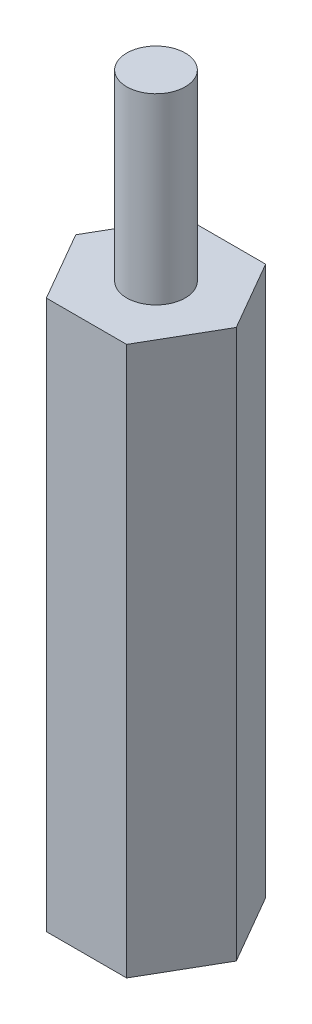
ISO-10303-21;
HEADER;
FILE_DESCRIPTION(('STEP AP214'),'2;1');
FILE_NAME('part.step','',(''),(''),'','','');
FILE_SCHEMA(('AUTOMOTIVE_DESIGN { 1 0 10303 214 1 1 1 1 }'));
ENDSEC;
DATA;
#1=APPLICATION_CONTEXT('core data for automotive mechanical design processes');
#2=APPLICATION_PROTOCOL_DEFINITION('international standard','automotive_design',2000,#1);
#3=PRODUCT_CONTEXT('',#1,'mechanical');
#4=PRODUCT('Part','Part','',(#3));
#5=PRODUCT_RELATED_PRODUCT_CATEGORY('part','',(#4));
#6=PRODUCT_DEFINITION_FORMATION('','',#4);
#7=PRODUCT_DEFINITION_CONTEXT('part definition',#1,'design');
#8=PRODUCT_DEFINITION('design','',#6,#7);
#9=PRODUCT_DEFINITION_SHAPE('','',#8);
#10=(LENGTH_UNIT() NAMED_UNIT(*) SI_UNIT(.MILLI.,.METRE.));
#11=(NAMED_UNIT(*) PLANE_ANGLE_UNIT() SI_UNIT($,.RADIAN.));
#12=(NAMED_UNIT(*) SI_UNIT($,.STERADIAN.) SOLID_ANGLE_UNIT());
#13=UNCERTAINTY_MEASURE_WITH_UNIT(LENGTH_MEASURE(1.E-05),#10,'distance_accuracy_value','');
#14=(GEOMETRIC_REPRESENTATION_CONTEXT(3) GLOBAL_UNCERTAINTY_ASSIGNED_CONTEXT((#13)) GLOBAL_UNIT_ASSIGNED_CONTEXT((#10,
#11,#12)) REPRESENTATION_CONTEXT('',''));
#15=CARTESIAN_POINT('',(0.,0.,0.));
#16=DIRECTION('',(0.,0.,1.));
#17=DIRECTION('',(1.,0.,0.));
#18=AXIS2_PLACEMENT_3D('',#15,#16,#17);
#19=CARTESIAN_POINT('',(-1.39314619955457,19.05,2.413));
#20=DIRECTION('',(0.,0.,-1.));
#21=DIRECTION('',(-1.,0.,0.));
#22=AXIS2_PLACEMENT_3D('',#19,#20,#21);
#23=PLANE('',#22);
#24=DIRECTION('',(1.,0.,0.));
#25=VECTOR('',#24,1.);
#26=CARTESIAN_POINT('',(-1.39314619955457,0.,2.413));
#27=LINE('',#26,#25);
#28=CARTESIAN_POINT('',(-1.39314619955457,0.,2.413));
#29=VERTEX_POINT('',#28);
#30=CARTESIAN_POINT('',(1.39314619955457,0.,2.413));
#31=VERTEX_POINT('',#30);
#32=EDGE_CURVE('E118',#29,#31,#27,.T.);
#33=ORIENTED_EDGE('',*,*,#32,.T.);
#34=DIRECTION('',(0.,-1.,0.));
#35=VECTOR('',#34,1.);
#36=CARTESIAN_POINT('',(1.39314619955457,19.05,2.413));
#37=LINE('',#36,#35);
#38=CARTESIAN_POINT('',(1.39314619955457,19.05,2.413));
#39=VERTEX_POINT('',#38);
#40=EDGE_CURVE('E35',#39,#31,#37,.T.);
#41=ORIENTED_EDGE('',*,*,#40,.F.);
#42=DIRECTION('',(1.,0.,0.));
#43=VECTOR('',#42,1.);
#44=CARTESIAN_POINT('',(-1.39314619955457,19.05,2.413));
#45=LINE('',#44,#43);
#46=CARTESIAN_POINT('',(-1.39314619955457,19.05,2.413));
#47=VERTEX_POINT('',#46);
#48=EDGE_CURVE('E129',#47,#39,#45,.T.);
#49=ORIENTED_EDGE('',*,*,#48,.F.);
#50=DIRECTION('',(0.,-1.,0.));
#51=VECTOR('',#50,1.);
#52=CARTESIAN_POINT('',(-1.39314619955457,19.05,2.413));
#53=LINE('',#52,#51);
#54=EDGE_CURVE('E114',#47,#29,#53,.T.);
#55=ORIENTED_EDGE('',*,*,#54,.T.);
#56=EDGE_LOOP('',(#33,#41,#49,#55));
#57=FACE_BOUND('',#56,.T.);
#58=ADVANCED_FACE('F32',(#57),#23,.F.);
#59=CARTESIAN_POINT('',(1.39314619955457,19.05,2.413));
#60=DIRECTION('',(-0.866025403784439,0.,-0.5));
#61=DIRECTION('',(-0.5,0.,0.866025403784438));
#62=AXIS2_PLACEMENT_3D('',#59,#60,#61);
#63=PLANE('',#62);
#64=DIRECTION('',(0.5,0.,-0.866025403784439));
#65=VECTOR('',#64,1.);
#66=CARTESIAN_POINT('',(1.39314619955457,0.,2.413));
#67=LINE('',#66,#65);
#68=CARTESIAN_POINT('',(2.78629239910913,0.,0.));
#69=VERTEX_POINT('',#68);
#70=EDGE_CURVE('E121',#31,#69,#67,.T.);
#71=ORIENTED_EDGE('',*,*,#70,.T.);
#72=DIRECTION('',(0.,-1.,0.));
#73=VECTOR('',#72,1.);
#74=CARTESIAN_POINT('',(2.78629239910913,19.05,0.));
#75=LINE('',#74,#73);
#76=CARTESIAN_POINT('',(2.78629239910913,19.05,0.));
#77=VERTEX_POINT('',#76);
#78=EDGE_CURVE('E132',#77,#69,#75,.T.);
#79=ORIENTED_EDGE('',*,*,#78,.F.);
#80=DIRECTION('',(0.5,0.,-0.866025403784439));
#81=VECTOR('',#80,1.);
#82=CARTESIAN_POINT('',(1.39314619955457,19.05,2.413));
#83=LINE('',#82,#81);
#84=EDGE_CURVE('E87',#39,#77,#83,.T.);
#85=ORIENTED_EDGE('',*,*,#84,.F.);
#86=ORIENTED_EDGE('',*,*,#40,.T.);
#87=EDGE_LOOP('',(#71,#79,#85,#86));
#88=FACE_BOUND('',#87,.T.);
#89=ADVANCED_FACE('F137',(#88),#63,.F.);
#90=CARTESIAN_POINT('',(2.78629239910913,19.05,0.));
#91=DIRECTION('',(-0.866025403784439,0.,0.5));
#92=DIRECTION('',(0.5,0.,0.866025403784439));
#93=AXIS2_PLACEMENT_3D('',#90,#91,#92);
#94=PLANE('',#93);
#95=DIRECTION('',(-0.5,0.,-0.866025403784439));
#96=VECTOR('',#95,1.);
#97=CARTESIAN_POINT('',(2.78629239910913,0.,0.));
#98=LINE('',#97,#96);
#99=CARTESIAN_POINT('',(1.39314619955457,0.,-2.413));
#100=VERTEX_POINT('',#99);
#101=EDGE_CURVE('E124',#69,#100,#98,.T.);
#102=ORIENTED_EDGE('',*,*,#101,.T.);
#103=DIRECTION('',(0.,-1.,0.));
#104=VECTOR('',#103,1.);
#105=CARTESIAN_POINT('',(1.39314619955457,19.05,-2.413));
#106=LINE('',#105,#104);
#107=CARTESIAN_POINT('',(1.39314619955457,19.05,-2.413));
#108=VERTEX_POINT('',#107);
#109=EDGE_CURVE('E109',#108,#100,#106,.T.);
#110=ORIENTED_EDGE('',*,*,#109,.F.);
#111=DIRECTION('',(-0.5,0.,-0.866025403784439));
#112=VECTOR('',#111,1.);
#113=CARTESIAN_POINT('',(2.78629239910913,19.05,0.));
#114=LINE('',#113,#112);
#115=EDGE_CURVE('E100',#77,#108,#114,.T.);
#116=ORIENTED_EDGE('',*,*,#115,.F.);
#117=ORIENTED_EDGE('',*,*,#78,.T.);
#118=EDGE_LOOP('',(#102,#110,#116,#117));
#119=FACE_BOUND('',#118,.T.);
#120=ADVANCED_FACE('F143',(#119),#94,.F.);
#121=CARTESIAN_POINT('',(1.39314619955457,19.05,-2.413));
#122=DIRECTION('',(0.,0.,1.));
#123=DIRECTION('',(1.,0.,0.));
#124=AXIS2_PLACEMENT_3D('',#121,#122,#123);
#125=PLANE('',#124);
#126=DIRECTION('',(-1.,0.,0.));
#127=VECTOR('',#126,1.);
#128=CARTESIAN_POINT('',(1.39314619955457,0.,-2.413));
#129=LINE('',#128,#127);
#130=CARTESIAN_POINT('',(-1.39314619955457,0.,-2.413));
#131=VERTEX_POINT('',#130);
#132=EDGE_CURVE('E108',#100,#131,#129,.T.);
#133=ORIENTED_EDGE('',*,*,#132,.T.);
#134=DIRECTION('',(0.,-1.,0.));
#135=VECTOR('',#134,1.);
#136=CARTESIAN_POINT('',(-1.39314619955457,19.05,-2.413));
#137=LINE('',#136,#135);
#138=CARTESIAN_POINT('',(-1.39314619955457,19.05,-2.413));
#139=VERTEX_POINT('',#138);
#140=EDGE_CURVE('E105',#139,#131,#137,.T.);
#141=ORIENTED_EDGE('',*,*,#140,.F.);
#142=DIRECTION('',(-1.,0.,0.));
#143=VECTOR('',#142,1.);
#144=CARTESIAN_POINT('',(1.39314619955457,19.05,-2.413));
#145=LINE('',#144,#143);
#146=EDGE_CURVE('E94',#108,#139,#145,.T.);
#147=ORIENTED_EDGE('',*,*,#146,.F.);
#148=ORIENTED_EDGE('',*,*,#109,.T.);
#149=EDGE_LOOP('',(#133,#141,#147,#148));
#150=FACE_BOUND('',#149,.T.);
#151=ADVANCED_FACE('F106',(#150),#125,.F.);
#152=CARTESIAN_POINT('',(-1.39314619955457,19.05,-2.413));
#153=DIRECTION('',(0.866025403784438,0.,0.5));
#154=DIRECTION('',(0.5,0.,-0.866025403784438));
#155=AXIS2_PLACEMENT_3D('',#152,#153,#154);
#156=PLANE('',#155);
#157=DIRECTION('',(-0.5,0.,0.866025403784438));
#158=VECTOR('',#157,1.);
#159=CARTESIAN_POINT('',(-1.39314619955457,0.,-2.413));
#160=LINE('',#159,#158);
#161=CARTESIAN_POINT('',(-2.78629239910913,0.,0.));
#162=VERTEX_POINT('',#161);
#163=EDGE_CURVE('E72',#131,#162,#160,.T.);
#164=ORIENTED_EDGE('',*,*,#163,.T.);
#165=DIRECTION('',(0.,-1.,0.));
#166=VECTOR('',#165,1.);
#167=CARTESIAN_POINT('',(-2.78629239910913,19.05,0.));
#168=LINE('',#167,#166);
#169=CARTESIAN_POINT('',(-2.78629239910913,19.05,0.));
#170=VERTEX_POINT('',#169);
#171=EDGE_CURVE('E110',#170,#162,#168,.T.);
#172=ORIENTED_EDGE('',*,*,#171,.F.);
#173=DIRECTION('',(-0.5,0.,0.866025403784438));
#174=VECTOR('',#173,1.);
#175=CARTESIAN_POINT('',(-1.39314619955457,19.05,-2.413));
#176=LINE('',#175,#174);
#177=EDGE_CURVE('E98',#139,#170,#176,.T.);
#178=ORIENTED_EDGE('',*,*,#177,.F.);
#179=ORIENTED_EDGE('',*,*,#140,.T.);
#180=EDGE_LOOP('',(#164,#172,#178,#179));
#181=FACE_BOUND('',#180,.T.);
#182=ADVANCED_FACE('F112',(#181),#156,.F.);
#183=CARTESIAN_POINT('',(-2.78629239910913,19.05,0.));
#184=DIRECTION('',(0.866025403784439,0.,-0.5));
#185=DIRECTION('',(-0.5,0.,-0.866025403784439));
#186=AXIS2_PLACEMENT_3D('',#183,#184,#185);
#187=PLANE('',#186);
#188=DIRECTION('',(0.5,0.,0.866025403784439));
#189=VECTOR('',#188,1.);
#190=CARTESIAN_POINT('',(-2.78629239910913,0.,0.));
#191=LINE('',#190,#189);
#192=EDGE_CURVE('E78',#162,#29,#191,.T.);
#193=ORIENTED_EDGE('',*,*,#192,.T.);
#194=ORIENTED_EDGE('',*,*,#54,.F.);
#195=DIRECTION('',(0.5,0.,0.866025403784439));
#196=VECTOR('',#195,1.);
#197=CARTESIAN_POINT('',(-2.78629239910913,19.05,0.));
#198=LINE('',#197,#196);
#199=EDGE_CURVE('E49',#170,#47,#198,.T.);
#200=ORIENTED_EDGE('',*,*,#199,.F.);
#201=ORIENTED_EDGE('',*,*,#171,.T.);
#202=EDGE_LOOP('',(#193,#194,#200,#201));
#203=FACE_BOUND('',#202,.T.);
#204=ADVANCED_FACE('F174',(#203),#187,.F.);
#205=CARTESIAN_POINT('',(0.,19.05,0.));
#206=DIRECTION('',(0.,1.,0.));
#207=DIRECTION('',(0.,0.,1.));
#208=AXIS2_PLACEMENT_3D('',#205,#206,#207);
#209=PLANE('',#208);
#210=CARTESIAN_POINT('',(0.,19.05,0.));
#211=DIRECTION('',(0.,1.,0.));
#212=DIRECTION('',(0.,0.,1.));
#213=AXIS2_PLACEMENT_3D('',#210,#211,#212);
#214=CIRCLE('',#213,1.016);
#215=CARTESIAN_POINT('',(0.,19.05,1.016));
#216=VERTEX_POINT('',#215);
#217=EDGE_CURVE('E11',#216,#216,#214,.T.);
#218=ORIENTED_EDGE('',*,*,#217,.F.);
#219=EDGE_LOOP('',(#218));
#220=FACE_BOUND('',#219,.T.);
#221=ORIENTED_EDGE('',*,*,#48,.T.);
#222=ORIENTED_EDGE('',*,*,#84,.T.);
#223=ORIENTED_EDGE('',*,*,#115,.T.);
#224=ORIENTED_EDGE('',*,*,#146,.T.);
#225=ORIENTED_EDGE('',*,*,#177,.T.);
#226=ORIENTED_EDGE('',*,*,#199,.T.);
#227=EDGE_LOOP('',(#221,#222,#223,#224,#225,#226));
#228=FACE_BOUND('',#227,.T.);
#229=ADVANCED_FACE('F96',(#220,#228),#209,.T.);
#230=CARTESIAN_POINT('',(0.,0.,0.));
#231=DIRECTION('',(0.,1.,0.));
#232=DIRECTION('',(0.,0.,1.));
#233=AXIS2_PLACEMENT_3D('',#230,#231,#232);
#234=PLANE('',#233);
#235=CARTESIAN_POINT('',(0.,0.,0.));
#236=DIRECTION('',(0.,-1.,0.));
#237=DIRECTION('',(0.,0.,-1.));
#238=AXIS2_PLACEMENT_3D('',#235,#236,#237);
#239=CIRCLE('',#238,1.016);
#240=CARTESIAN_POINT('',(0.,0.,-1.016));
#241=VERTEX_POINT('',#240);
#242=EDGE_CURVE('E150',#241,#241,#239,.T.);
#243=ORIENTED_EDGE('',*,*,#242,.F.);
#244=EDGE_LOOP('',(#243));
#245=FACE_BOUND('',#244,.T.);
#246=ORIENTED_EDGE('',*,*,#32,.F.);
#247=ORIENTED_EDGE('',*,*,#192,.F.);
#248=ORIENTED_EDGE('',*,*,#163,.F.);
#249=ORIENTED_EDGE('',*,*,#132,.F.);
#250=ORIENTED_EDGE('',*,*,#101,.F.);
#251=ORIENTED_EDGE('',*,*,#70,.F.);
#252=EDGE_LOOP('',(#246,#247,#248,#249,#250,#251));
#253=FACE_BOUND('',#252,.T.);
#254=ADVANCED_FACE('F142',(#245,#253),#234,.F.);
#255=CARTESIAN_POINT('',(0.,25.4,0.));
#256=DIRECTION('',(0.,-1.,0.));
#257=DIRECTION('',(0.,0.,-1.));
#258=AXIS2_PLACEMENT_3D('',#255,#256,#257);
#259=CYLINDRICAL_SURFACE('',#258,1.016);
#260=CARTESIAN_POINT('',(0.,25.4,0.));
#261=DIRECTION('',(0.,1.,0.));
#262=DIRECTION('',(0.,0.,1.));
#263=AXIS2_PLACEMENT_3D('',#260,#261,#262);
#264=CIRCLE('',#263,1.016);
#265=CARTESIAN_POINT('',(0.,25.4,1.016));
#266=VERTEX_POINT('',#265);
#267=EDGE_CURVE('E122',#266,#266,#264,.T.);
#268=ORIENTED_EDGE('',*,*,#267,.F.);
#269=EDGE_LOOP('',(#268));
#270=FACE_BOUND('',#269,.T.);
#271=ORIENTED_EDGE('',*,*,#217,.T.);
#272=EDGE_LOOP('',(#271));
#273=FACE_BOUND('',#272,.T.);
#274=ADVANCED_FACE('F166',(#270,#273),#259,.T.);
#275=CARTESIAN_POINT('',(0.,25.4,0.));
#276=DIRECTION('',(0.,1.,0.));
#277=DIRECTION('',(0.,0.,1.));
#278=AXIS2_PLACEMENT_3D('',#275,#276,#277);
#279=PLANE('',#278);
#280=ORIENTED_EDGE('',*,*,#267,.T.);
#281=EDGE_LOOP('',(#280));
#282=FACE_BOUND('',#281,.T.);
#283=ADVANCED_FACE('F161',(#282),#279,.T.);
#284=CARTESIAN_POINT('',(0.,6.35,0.));
#285=DIRECTION('',(0.,-1.,0.));
#286=DIRECTION('',(0.,0.,-1.));
#287=AXIS2_PLACEMENT_3D('',#284,#285,#286);
#288=CYLINDRICAL_SURFACE('',#287,1.016);
#289=CARTESIAN_POINT('',(0.,6.35,0.));
#290=DIRECTION('',(0.,-1.,0.));
#291=DIRECTION('',(0.,0.,-1.));
#292=AXIS2_PLACEMENT_3D('',#289,#290,#291);
#293=CIRCLE('',#292,1.016);
#294=CARTESIAN_POINT('',(0.,6.35,-1.016));
#295=VERTEX_POINT('',#294);
#296=EDGE_CURVE('E149',#295,#295,#293,.T.);
#297=ORIENTED_EDGE('',*,*,#296,.F.);
#298=EDGE_LOOP('',(#297));
#299=FACE_BOUND('',#298,.T.);
#300=ORIENTED_EDGE('',*,*,#242,.T.);
#301=EDGE_LOOP('',(#300));
#302=FACE_BOUND('',#301,.T.);
#303=ADVANCED_FACE('F158',(#299,#302),#288,.F.);
#304=CARTESIAN_POINT('',(0.,6.35,0.));
#305=DIRECTION('',(0.,-1.,0.));
#306=DIRECTION('',(0.,0.,-1.));
#307=AXIS2_PLACEMENT_3D('',#304,#305,#306);
#308=PLANE('',#307);
#309=ORIENTED_EDGE('',*,*,#296,.T.);
#310=EDGE_LOOP('',(#309));
#311=FACE_BOUND('',#310,.T.);
#312=ADVANCED_FACE('F156',(#311),#308,.T.);
#313=CLOSED_SHELL('',(#58,#89,#120,#151,#182,#204,#229,#254,#274,#283,#303,#312));
#314=MANIFOLD_SOLID_BREP('B2',#313);
#315=ADVANCED_BREP_SHAPE_REPRESENTATION('',(#18,#314),#14);
#316=SHAPE_DEFINITION_REPRESENTATION(#9,#315);
ENDSEC;
END-ISO-10303-21;
